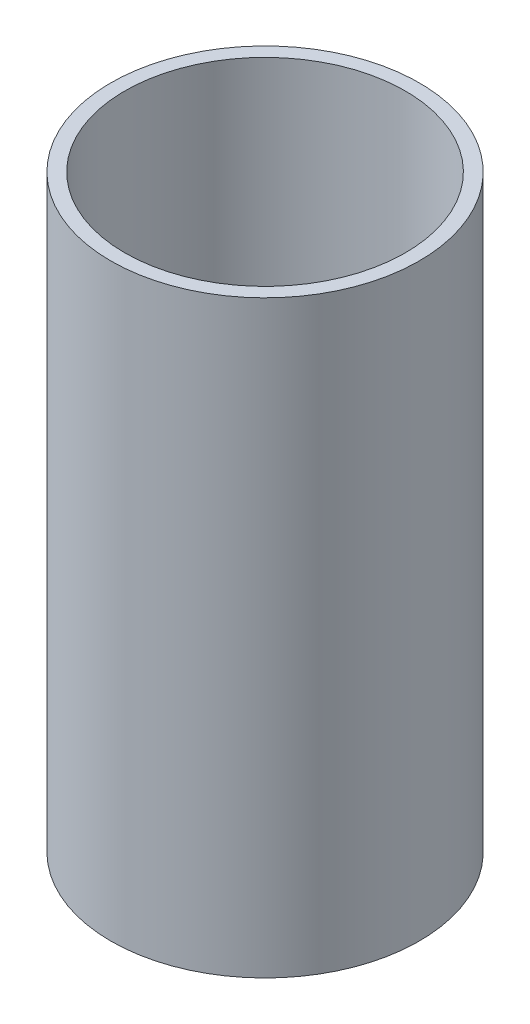
ISO-10303-21;
HEADER;
FILE_DESCRIPTION(('STEP AP214'),'2;1');
FILE_NAME('part.step','',(''),(''),'','','');
FILE_SCHEMA(('AUTOMOTIVE_DESIGN { 1 0 10303 214 1 1 1 1 }'));
ENDSEC;
DATA;
#1=APPLICATION_CONTEXT('core data for automotive mechanical design processes');
#2=APPLICATION_PROTOCOL_DEFINITION('international standard','automotive_design',2000,#1);
#3=PRODUCT_CONTEXT('',#1,'mechanical');
#4=PRODUCT('Part','Part','',(#3));
#5=PRODUCT_RELATED_PRODUCT_CATEGORY('part','',(#4));
#6=PRODUCT_DEFINITION_FORMATION('','',#4);
#7=PRODUCT_DEFINITION_CONTEXT('part definition',#1,'design');
#8=PRODUCT_DEFINITION('design','',#6,#7);
#9=PRODUCT_DEFINITION_SHAPE('','',#8);
#10=(LENGTH_UNIT() NAMED_UNIT(*) SI_UNIT(.MILLI.,.METRE.));
#11=(NAMED_UNIT(*) PLANE_ANGLE_UNIT() SI_UNIT($,.RADIAN.));
#12=(NAMED_UNIT(*) SI_UNIT($,.STERADIAN.) SOLID_ANGLE_UNIT());
#13=UNCERTAINTY_MEASURE_WITH_UNIT(LENGTH_MEASURE(1.E-05),#10,'distance_accuracy_value','');
#14=(GEOMETRIC_REPRESENTATION_CONTEXT(3) GLOBAL_UNCERTAINTY_ASSIGNED_CONTEXT((#13)) GLOBAL_UNIT_ASSIGNED_CONTEXT((#10,
#11,#12)) REPRESENTATION_CONTEXT('',''));
#15=CARTESIAN_POINT('',(0.,0.,0.));
#16=DIRECTION('',(0.,0.,1.));
#17=DIRECTION('',(1.,0.,0.));
#18=AXIS2_PLACEMENT_3D('',#15,#16,#17);
#19=CARTESIAN_POINT('',(0.,160.,0.));
#20=DIRECTION('',(0.,1.,0.));
#21=DIRECTION('',(0.,0.,1.));
#22=AXIS2_PLACEMENT_3D('',#19,#20,#21);
#23=PLANE('',#22);
#24=CARTESIAN_POINT('',(0.,160.,0.));
#25=DIRECTION('',(0.,1.,0.));
#26=DIRECTION('',(0.,0.,1.));
#27=AXIS2_PLACEMENT_3D('',#24,#25,#26);
#28=CIRCLE('',#27,41.9);
#29=CARTESIAN_POINT('',(0.,160.,41.9));
#30=VERTEX_POINT('',#29);
#31=EDGE_CURVE('E10',#30,#30,#28,.T.);
#32=ORIENTED_EDGE('',*,*,#31,.T.);
#33=EDGE_LOOP('',(#32));
#34=FACE_BOUND('',#33,.T.);
#35=CARTESIAN_POINT('',(0.,160.,0.));
#36=DIRECTION('',(0.,1.,0.));
#37=DIRECTION('',(0.,0.,1.));
#38=AXIS2_PLACEMENT_3D('',#35,#36,#37);
#39=CIRCLE('',#38,38.1);
#40=CARTESIAN_POINT('',(0.,160.,38.1));
#41=VERTEX_POINT('',#40);
#42=EDGE_CURVE('E51',#41,#41,#39,.T.);
#43=ORIENTED_EDGE('',*,*,#42,.F.);
#44=EDGE_LOOP('',(#43));
#45=FACE_BOUND('',#44,.T.);
#46=ADVANCED_FACE('F40',(#34,#45),#23,.T.);
#47=CARTESIAN_POINT('',(0.,0.,0.));
#48=DIRECTION('',(0.,1.,0.));
#49=DIRECTION('',(0.,0.,1.));
#50=AXIS2_PLACEMENT_3D('',#47,#48,#49);
#51=PLANE('',#50);
#52=CARTESIAN_POINT('',(0.,0.,0.));
#53=DIRECTION('',(0.,1.,0.));
#54=DIRECTION('',(0.,0.,1.));
#55=AXIS2_PLACEMENT_3D('',#52,#53,#54);
#56=CIRCLE('',#55,41.9);
#57=CARTESIAN_POINT('',(0.,0.,41.9));
#58=VERTEX_POINT('',#57);
#59=EDGE_CURVE('E44',#58,#58,#56,.T.);
#60=ORIENTED_EDGE('',*,*,#59,.F.);
#61=EDGE_LOOP('',(#60));
#62=FACE_BOUND('',#61,.T.);
#63=CARTESIAN_POINT('',(0.,0.,0.));
#64=DIRECTION('',(0.,1.,0.));
#65=DIRECTION('',(0.,0.,1.));
#66=AXIS2_PLACEMENT_3D('',#63,#64,#65);
#67=CIRCLE('',#66,38.1);
#68=CARTESIAN_POINT('',(0.,0.,38.1));
#69=VERTEX_POINT('',#68);
#70=EDGE_CURVE('E53',#69,#69,#67,.T.);
#71=ORIENTED_EDGE('',*,*,#70,.T.);
#72=EDGE_LOOP('',(#71));
#73=FACE_BOUND('',#72,.T.);
#74=ADVANCED_FACE('F63',(#62,#73),#51,.F.);
#75=CARTESIAN_POINT('',(0.,160.,0.));
#76=DIRECTION('',(0.,-1.,0.));
#77=DIRECTION('',(0.,0.,-1.));
#78=AXIS2_PLACEMENT_3D('',#75,#76,#77);
#79=CYLINDRICAL_SURFACE('',#78,41.9);
#80=ORIENTED_EDGE('',*,*,#31,.F.);
#81=EDGE_LOOP('',(#80));
#82=FACE_BOUND('',#81,.T.);
#83=ORIENTED_EDGE('',*,*,#59,.T.);
#84=EDGE_LOOP('',(#83));
#85=FACE_BOUND('',#84,.T.);
#86=ADVANCED_FACE('F42',(#82,#85),#79,.T.);
#87=CARTESIAN_POINT('',(0.,160.,0.));
#88=DIRECTION('',(0.,-1.,0.));
#89=DIRECTION('',(0.,0.,-1.));
#90=AXIS2_PLACEMENT_3D('',#87,#88,#89);
#91=CYLINDRICAL_SURFACE('',#90,38.1);
#92=ORIENTED_EDGE('',*,*,#42,.T.);
#93=EDGE_LOOP('',(#92));
#94=FACE_BOUND('',#93,.T.);
#95=ORIENTED_EDGE('',*,*,#70,.F.);
#96=EDGE_LOOP('',(#95));
#97=FACE_BOUND('',#96,.T.);
#98=ADVANCED_FACE('F59',(#94,#97),#91,.F.);
#99=CLOSED_SHELL('',(#46,#74,#86,#98));
#100=MANIFOLD_SOLID_BREP('B2',#99);
#101=ADVANCED_BREP_SHAPE_REPRESENTATION('',(#18,#100),#14);
#102=SHAPE_DEFINITION_REPRESENTATION(#9,#101);
ENDSEC;
END-ISO-10303-21;
